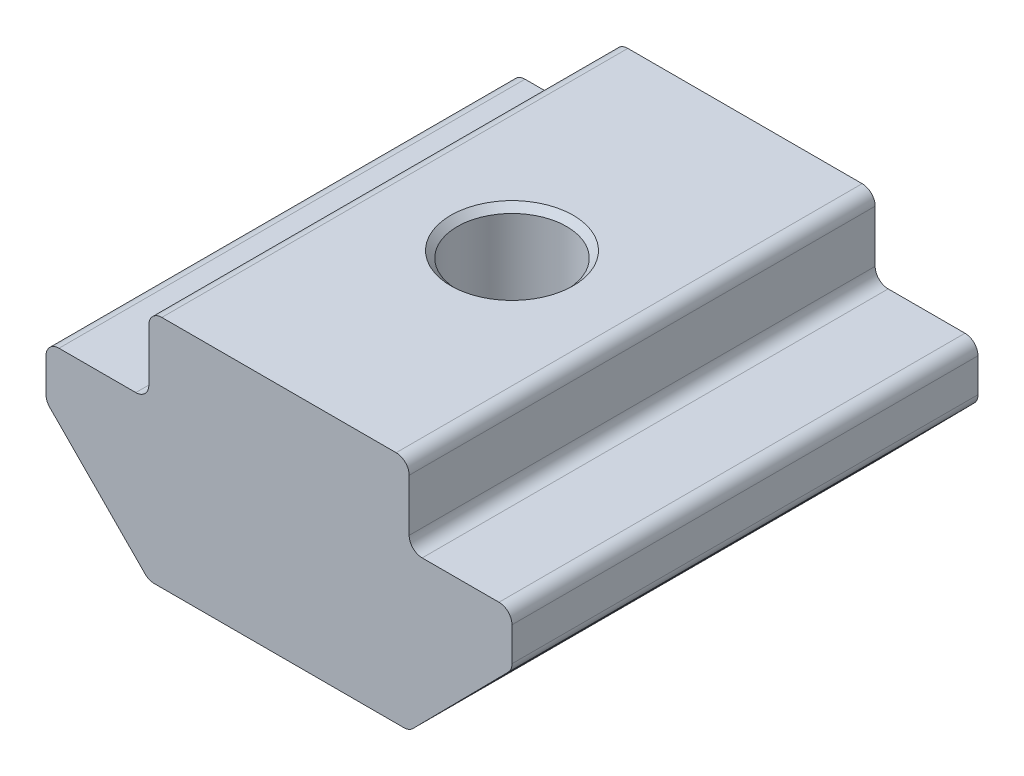
ISO-10303-21;
HEADER;
FILE_DESCRIPTION(('STEP AP214'),'2;1');
FILE_NAME('part.step','',(''),(''),'','','');
FILE_SCHEMA(('AUTOMOTIVE_DESIGN { 1 0 10303 214 1 1 1 1 }'));
ENDSEC;
DATA;
#1=APPLICATION_CONTEXT('core data for automotive mechanical design processes');
#2=APPLICATION_PROTOCOL_DEFINITION('international standard','automotive_design',2000,#1);
#3=PRODUCT_CONTEXT('',#1,'mechanical');
#4=PRODUCT('Part','Part','',(#3));
#5=PRODUCT_RELATED_PRODUCT_CATEGORY('part','',(#4));
#6=PRODUCT_DEFINITION_FORMATION('','',#4);
#7=PRODUCT_DEFINITION_CONTEXT('part definition',#1,'design');
#8=PRODUCT_DEFINITION('design','',#6,#7);
#9=PRODUCT_DEFINITION_SHAPE('','',#8);
#10=(LENGTH_UNIT() NAMED_UNIT(*) SI_UNIT(.MILLI.,.METRE.));
#11=(NAMED_UNIT(*) PLANE_ANGLE_UNIT() SI_UNIT($,.RADIAN.));
#12=(NAMED_UNIT(*) SI_UNIT($,.STERADIAN.) SOLID_ANGLE_UNIT());
#13=UNCERTAINTY_MEASURE_WITH_UNIT(LENGTH_MEASURE(1.E-05),#10,'distance_accuracy_value','');
#14=(GEOMETRIC_REPRESENTATION_CONTEXT(3) GLOBAL_UNCERTAINTY_ASSIGNED_CONTEXT((#13)) GLOBAL_UNIT_ASSIGNED_CONTEXT((#10,
#11,#12)) REPRESENTATION_CONTEXT('',''));
#15=CARTESIAN_POINT('',(0.,0.,0.));
#16=DIRECTION('',(0.,0.,1.));
#17=DIRECTION('',(1.,0.,0.));
#18=AXIS2_PLACEMENT_3D('',#15,#16,#17);
#19=CARTESIAN_POINT('',(-5.,1.5,8.95));
#20=DIRECTION('',(1.,0.,0.));
#21=DIRECTION('',(0.,0.,-1.));
#22=AXIS2_PLACEMENT_3D('',#19,#20,#21);
#23=PLANE('',#22);
#24=DIRECTION('',(0.,-1.,0.));
#25=VECTOR('',#24,1.);
#26=CARTESIAN_POINT('',(-5.,1.5,-8.95));
#27=LINE('',#26,#25);
#28=CARTESIAN_POINT('',(-5.,4.,-8.95));
#29=VERTEX_POINT('',#28);
#30=CARTESIAN_POINT('',(-5.,2.,-8.95));
#31=VERTEX_POINT('',#30);
#32=EDGE_CURVE('E184',#29,#31,#27,.T.);
#33=ORIENTED_EDGE('',*,*,#32,.T.);
#34=DIRECTION('',(0.,0.,-1.));
#35=VECTOR('',#34,1.);
#36=CARTESIAN_POINT('',(-5.,2.,8.95));
#37=LINE('',#36,#35);
#38=CARTESIAN_POINT('',(-5.,2.,8.95));
#39=VERTEX_POINT('',#38);
#40=EDGE_CURVE('E160',#31,#39,#37,.F.);
#41=ORIENTED_EDGE('',*,*,#40,.T.);
#42=DIRECTION('',(0.,-1.,0.));
#43=VECTOR('',#42,1.);
#44=CARTESIAN_POINT('',(-5.,1.5,8.95));
#45=LINE('',#44,#43);
#46=CARTESIAN_POINT('',(-5.,4.,8.95));
#47=VERTEX_POINT('',#46);
#48=EDGE_CURVE('E212',#47,#39,#45,.T.);
#49=ORIENTED_EDGE('',*,*,#48,.F.);
#50=DIRECTION('',(0.,0.,-1.));
#51=VECTOR('',#50,1.);
#52=CARTESIAN_POINT('',(-5.,4.,8.95));
#53=LINE('',#52,#51);
#54=EDGE_CURVE('E176',#47,#29,#53,.T.);
#55=ORIENTED_EDGE('',*,*,#54,.T.);
#56=EDGE_LOOP('',(#33,#41,#49,#55));
#57=FACE_BOUND('',#56,.T.);
#58=ADVANCED_FACE('F16',(#57),#23,.F.);
#59=CARTESIAN_POINT('',(-8.95,1.5,8.95));
#60=DIRECTION('',(0.,-1.,0.));
#61=DIRECTION('',(0.,0.,-1.));
#62=AXIS2_PLACEMENT_3D('',#59,#60,#61);
#63=PLANE('',#62);
#64=DIRECTION('',(-1.,0.,0.));
#65=VECTOR('',#64,1.);
#66=CARTESIAN_POINT('',(-8.95,1.5,8.95));
#67=LINE('',#66,#65);
#68=CARTESIAN_POINT('',(-5.5,1.5,8.95));
#69=VERTEX_POINT('',#68);
#70=CARTESIAN_POINT('',(-8.45,1.5,8.95));
#71=VERTEX_POINT('',#70);
#72=EDGE_CURVE('E175',#69,#71,#67,.T.);
#73=ORIENTED_EDGE('',*,*,#72,.F.);
#74=DIRECTION('',(0.,0.,-1.));
#75=VECTOR('',#74,1.);
#76=CARTESIAN_POINT('',(-5.5,1.5,-8.95));
#77=LINE('',#76,#75);
#78=CARTESIAN_POINT('',(-5.5,1.5,-8.95));
#79=VERTEX_POINT('',#78);
#80=EDGE_CURVE('E159',#69,#79,#77,.T.);
#81=ORIENTED_EDGE('',*,*,#80,.T.);
#82=DIRECTION('',(-1.,0.,0.));
#83=VECTOR('',#82,1.);
#84=CARTESIAN_POINT('',(-8.95,1.5,-8.95));
#85=LINE('',#84,#83);
#86=CARTESIAN_POINT('',(-8.45,1.5,-8.95));
#87=VERTEX_POINT('',#86);
#88=EDGE_CURVE('E172',#79,#87,#85,.T.);
#89=ORIENTED_EDGE('',*,*,#88,.T.);
#90=DIRECTION('',(0.,0.,-1.));
#91=VECTOR('',#90,1.);
#92=CARTESIAN_POINT('',(-8.45,1.5,8.95));
#93=LINE('',#92,#91);
#94=EDGE_CURVE('E177',#87,#71,#93,.F.);
#95=ORIENTED_EDGE('',*,*,#94,.T.);
#96=EDGE_LOOP('',(#73,#81,#89,#95));
#97=FACE_BOUND('',#96,.T.);
#98=ADVANCED_FACE('F171',(#97),#63,.F.);
#99=CARTESIAN_POINT('',(-8.95,1.5,8.95));
#100=DIRECTION('',(1.,0.,0.));
#101=DIRECTION('',(0.,0.,-1.));
#102=AXIS2_PLACEMENT_3D('',#99,#100,#101);
#103=PLANE('',#102);
#104=DIRECTION('',(0.,-1.,0.));
#105=VECTOR('',#104,1.);
#106=CARTESIAN_POINT('',(-8.95,1.5,-8.95));
#107=LINE('',#106,#105);
#108=CARTESIAN_POINT('',(-8.95,0.999999999999999,-8.95));
#109=VERTEX_POINT('',#108);
#110=CARTESIAN_POINT('',(-8.95,-0.294732900044921,-8.95));
#111=VERTEX_POINT('',#110);
#112=EDGE_CURVE('E183',#109,#111,#107,.T.);
#113=ORIENTED_EDGE('',*,*,#112,.T.);
#114=DIRECTION('',(0.,0.,-1.));
#115=VECTOR('',#114,1.);
#116=CARTESIAN_POINT('',(-8.95,-0.294732900044921,8.95));
#117=LINE('',#116,#115);
#118=CARTESIAN_POINT('',(-8.95,-0.294732900044921,8.95));
#119=VERTEX_POINT('',#118);
#120=EDGE_CURVE('E280',#111,#119,#117,.F.);
#121=ORIENTED_EDGE('',*,*,#120,.T.);
#122=DIRECTION('',(0.,-1.,0.));
#123=VECTOR('',#122,1.);
#124=CARTESIAN_POINT('',(-8.95,1.5,8.95));
#125=LINE('',#124,#123);
#126=CARTESIAN_POINT('',(-8.95,0.999999999999999,8.95));
#127=VERTEX_POINT('',#126);
#128=EDGE_CURVE('E420',#127,#119,#125,.T.);
#129=ORIENTED_EDGE('',*,*,#128,.F.);
#130=DIRECTION('',(0.,0.,-1.));
#131=VECTOR('',#130,1.);
#132=CARTESIAN_POINT('',(-8.95,0.999999999999999,8.95));
#133=LINE('',#132,#131);
#134=EDGE_CURVE('E277',#127,#109,#133,.T.);
#135=ORIENTED_EDGE('',*,*,#134,.T.);
#136=EDGE_LOOP('',(#113,#121,#129,#135));
#137=FACE_BOUND('',#136,.T.);
#138=ADVANCED_FACE('F312',(#137),#103,.F.);
#139=CARTESIAN_POINT('',(-8.95,-0.500000000000001,8.95));
#140=DIRECTION('',(0.711539921163849,0.702645672149302,0.));
#141=DIRECTION('',(-0.702645672149302,0.711539921163849,0.));
#142=AXIS2_PLACEMENT_3D('',#139,#140,#141);
#143=PLANE('',#142);
#144=DIRECTION('',(0.702645672149302,-0.711539921163849,0.));
#145=VECTOR('',#144,1.);
#146=CARTESIAN_POINT('',(-8.95,-0.500000000000001,-8.95));
#147=LINE('',#146,#145);
#148=CARTESIAN_POINT('',(-8.80576996058193,-0.646055736119572,-8.95));
#149=VERTEX_POINT('',#148);
#150=CARTESIAN_POINT('',(-5.14681869937628,-4.35132283607465,-8.95));
#151=VERTEX_POINT('',#150);
#152=EDGE_CURVE('E187',#149,#151,#147,.T.);
#153=ORIENTED_EDGE('',*,*,#152,.T.);
#154=DIRECTION('',(0.,0.,-1.));
#155=VECTOR('',#154,1.);
#156=CARTESIAN_POINT('',(-5.14681869937628,-4.35132283607465,8.95));
#157=LINE('',#156,#155);
#158=CARTESIAN_POINT('',(-5.14681869937628,-4.35132283607465,8.95));
#159=VERTEX_POINT('',#158);
#160=EDGE_CURVE('E261',#151,#159,#157,.F.);
#161=ORIENTED_EDGE('',*,*,#160,.T.);
#162=DIRECTION('',(0.702645672149302,-0.711539921163849,0.));
#163=VECTOR('',#162,1.);
#164=CARTESIAN_POINT('',(-8.95,-0.500000000000001,8.95));
#165=LINE('',#164,#163);
#166=CARTESIAN_POINT('',(-8.80576996058193,-0.646055736119572,8.95));
#167=VERTEX_POINT('',#166);
#168=EDGE_CURVE('E413',#167,#159,#165,.T.);
#169=ORIENTED_EDGE('',*,*,#168,.F.);
#170=DIRECTION('',(0.,0.,-1.));
#171=VECTOR('',#170,1.);
#172=CARTESIAN_POINT('',(-8.80576996058193,-0.646055736119572,8.95));
#173=LINE('',#172,#171);
#174=EDGE_CURVE('E258',#167,#149,#173,.T.);
#175=ORIENTED_EDGE('',*,*,#174,.T.);
#176=EDGE_LOOP('',(#153,#161,#169,#175));
#177=FACE_BOUND('',#176,.T.);
#178=ADVANCED_FACE('F409',(#177),#143,.F.);
#179=CARTESIAN_POINT('',(5.,-4.5,8.95));
#180=DIRECTION('',(0.,1.,0.));
#181=DIRECTION('',(-1.,0.,0.));
#182=AXIS2_PLACEMENT_3D('',#179,#180,#181);
#183=PLANE('',#182);
#184=CARTESIAN_POINT('',(0.,-4.5,0.));
#185=DIRECTION('',(0.,1.,0.));
#186=DIRECTION('',(-1.,0.,0.));
#187=AXIS2_PLACEMENT_3D('',#184,#185,#186);
#188=CIRCLE('',#187,2.1);
#189=CARTESIAN_POINT('',(-2.1,-4.5,0.));
#190=VERTEX_POINT('',#189);
#191=EDGE_CURVE('E189',#190,#190,#188,.T.);
#192=ORIENTED_EDGE('',*,*,#191,.T.);
#193=EDGE_LOOP('',(#192));
#194=FACE_BOUND('',#193,.T.);
#195=DIRECTION('',(1.,0.,0.));
#196=VECTOR('',#195,1.);
#197=CARTESIAN_POINT('',(5.,-4.5,-8.95));
#198=LINE('',#197,#196);
#199=CARTESIAN_POINT('',(-4.79104873879436,-4.5,-8.95));
#200=VERTEX_POINT('',#199);
#201=CARTESIAN_POINT('',(4.79104873879436,-4.5,-8.95));
#202=VERTEX_POINT('',#201);
#203=EDGE_CURVE('E195',#200,#202,#198,.T.);
#204=ORIENTED_EDGE('',*,*,#203,.T.);
#205=DIRECTION('',(0.,0.,-1.));
#206=VECTOR('',#205,1.);
#207=CARTESIAN_POINT('',(4.79104873879436,-4.5,8.95));
#208=LINE('',#207,#206);
#209=CARTESIAN_POINT('',(4.79104873879436,-4.5,8.95));
#210=VERTEX_POINT('',#209);
#211=EDGE_CURVE('E241',#202,#210,#208,.F.);
#212=ORIENTED_EDGE('',*,*,#211,.T.);
#213=DIRECTION('',(1.,0.,0.));
#214=VECTOR('',#213,1.);
#215=CARTESIAN_POINT('',(5.,-4.5,8.95));
#216=LINE('',#215,#214);
#217=CARTESIAN_POINT('',(-4.79104873879436,-4.5,8.95));
#218=VERTEX_POINT('',#217);
#219=EDGE_CURVE('E371',#218,#210,#216,.T.);
#220=ORIENTED_EDGE('',*,*,#219,.F.);
#221=DIRECTION('',(0.,0.,-1.));
#222=VECTOR('',#221,1.);
#223=CARTESIAN_POINT('',(-4.79104873879436,-4.5,8.95));
#224=LINE('',#223,#222);
#225=EDGE_CURVE('E238',#218,#200,#224,.T.);
#226=ORIENTED_EDGE('',*,*,#225,.T.);
#227=EDGE_LOOP('',(#204,#212,#220,#226));
#228=FACE_BOUND('',#227,.T.);
#229=ADVANCED_FACE('F402',(#194,#228),#183,.F.);
#230=CARTESIAN_POINT('',(8.95,-0.500000000000001,8.95));
#231=DIRECTION('',(-0.71153992116385,0.702645672149301,0.));
#232=DIRECTION('',(-0.702645672149301,-0.71153992116385,0.));
#233=AXIS2_PLACEMENT_3D('',#230,#231,#232);
#234=PLANE('',#233);
#235=DIRECTION('',(0.702645672149301,0.71153992116385,0.));
#236=VECTOR('',#235,1.);
#237=CARTESIAN_POINT('',(8.95,-0.500000000000001,8.95));
#238=LINE('',#237,#236);
#239=CARTESIAN_POINT('',(5.14681869937628,-4.35132283607465,8.95));
#240=VERTEX_POINT('',#239);
#241=CARTESIAN_POINT('',(8.80576996058192,-0.646055736119571,8.95));
#242=VERTEX_POINT('',#241);
#243=EDGE_CURVE('E361',#240,#242,#238,.T.);
#244=ORIENTED_EDGE('',*,*,#243,.F.);
#245=DIRECTION('',(0.,0.,-1.));
#246=VECTOR('',#245,1.);
#247=CARTESIAN_POINT('',(5.14681869937628,-4.35132283607465,8.95));
#248=LINE('',#247,#246);
#249=CARTESIAN_POINT('',(5.14681869937628,-4.35132283607465,-8.95));
#250=VERTEX_POINT('',#249);
#251=EDGE_CURVE('E220',#240,#250,#248,.T.);
#252=ORIENTED_EDGE('',*,*,#251,.T.);
#253=DIRECTION('',(0.702645672149301,0.71153992116385,0.));
#254=VECTOR('',#253,1.);
#255=CARTESIAN_POINT('',(8.95,-0.500000000000001,-8.95));
#256=LINE('',#255,#254);
#257=CARTESIAN_POINT('',(8.80576996058192,-0.646055736119571,-8.95));
#258=VERTEX_POINT('',#257);
#259=EDGE_CURVE('E198',#250,#258,#256,.T.);
#260=ORIENTED_EDGE('',*,*,#259,.T.);
#261=DIRECTION('',(0.,0.,-1.));
#262=VECTOR('',#261,1.);
#263=CARTESIAN_POINT('',(8.80576996058192,-0.646055736119571,8.95));
#264=LINE('',#263,#262);
#265=EDGE_CURVE('E218',#258,#242,#264,.F.);
#266=ORIENTED_EDGE('',*,*,#265,.T.);
#267=EDGE_LOOP('',(#244,#252,#260,#266));
#268=FACE_BOUND('',#267,.T.);
#269=ADVANCED_FACE('F396',(#268),#234,.F.);
#270=CARTESIAN_POINT('',(8.95,1.5,8.95));
#271=DIRECTION('',(-1.,0.,0.));
#272=DIRECTION('',(0.,0.,1.));
#273=AXIS2_PLACEMENT_3D('',#270,#271,#272);
#274=PLANE('',#273);
#275=DIRECTION('',(0.,1.,0.));
#276=VECTOR('',#275,1.);
#277=CARTESIAN_POINT('',(8.95,1.5,8.95));
#278=LINE('',#277,#276);
#279=CARTESIAN_POINT('',(8.95,-0.29473290004492,8.95));
#280=VERTEX_POINT('',#279);
#281=CARTESIAN_POINT('',(8.95,0.999999999999999,8.95));
#282=VERTEX_POINT('',#281);
#283=EDGE_CURVE('E358',#280,#282,#278,.T.);
#284=ORIENTED_EDGE('',*,*,#283,.F.);
#285=DIRECTION('',(0.,0.,-1.));
#286=VECTOR('',#285,1.);
#287=CARTESIAN_POINT('',(8.95,-0.29473290004492,8.95));
#288=LINE('',#287,#286);
#289=CARTESIAN_POINT('',(8.95,-0.29473290004492,-8.95));
#290=VERTEX_POINT('',#289);
#291=EDGE_CURVE('E166',#280,#290,#288,.T.);
#292=ORIENTED_EDGE('',*,*,#291,.T.);
#293=DIRECTION('',(0.,1.,0.));
#294=VECTOR('',#293,1.);
#295=CARTESIAN_POINT('',(8.95,1.5,-8.95));
#296=LINE('',#295,#294);
#297=CARTESIAN_POINT('',(8.95,0.999999999999999,-8.95));
#298=VERTEX_POINT('',#297);
#299=EDGE_CURVE('E201',#290,#298,#296,.T.);
#300=ORIENTED_EDGE('',*,*,#299,.T.);
#301=DIRECTION('',(0.,0.,-1.));
#302=VECTOR('',#301,1.);
#303=CARTESIAN_POINT('',(8.95,0.999999999999999,8.95));
#304=LINE('',#303,#302);
#305=EDGE_CURVE('E282',#298,#282,#304,.F.);
#306=ORIENTED_EDGE('',*,*,#305,.T.);
#307=EDGE_LOOP('',(#284,#292,#300,#306));
#308=FACE_BOUND('',#307,.T.);
#309=ADVANCED_FACE('F363',(#308),#274,.F.);
#310=CARTESIAN_POINT('',(5.,1.5,8.95));
#311=DIRECTION('',(0.,-1.,0.));
#312=DIRECTION('',(0.,0.,-1.));
#313=AXIS2_PLACEMENT_3D('',#310,#311,#312);
#314=PLANE('',#313);
#315=DIRECTION('',(-1.,0.,0.));
#316=VECTOR('',#315,1.);
#317=CARTESIAN_POINT('',(5.,1.5,-8.95));
#318=LINE('',#317,#316);
#319=CARTESIAN_POINT('',(8.45,1.5,-8.95));
#320=VERTEX_POINT('',#319);
#321=CARTESIAN_POINT('',(5.5,1.5,-8.95));
#322=VERTEX_POINT('',#321);
#323=EDGE_CURVE('E204',#320,#322,#318,.T.);
#324=ORIENTED_EDGE('',*,*,#323,.T.);
#325=DIRECTION('',(0.,0.,-1.));
#326=VECTOR('',#325,1.);
#327=CARTESIAN_POINT('',(5.5,1.5,8.95));
#328=LINE('',#327,#326);
#329=CARTESIAN_POINT('',(5.5,1.5,8.95));
#330=VERTEX_POINT('',#329);
#331=EDGE_CURVE('E275',#322,#330,#328,.F.);
#332=ORIENTED_EDGE('',*,*,#331,.T.);
#333=DIRECTION('',(-1.,0.,0.));
#334=VECTOR('',#333,1.);
#335=CARTESIAN_POINT('',(5.,1.5,8.95));
#336=LINE('',#335,#334);
#337=CARTESIAN_POINT('',(8.45,1.5,8.95));
#338=VERTEX_POINT('',#337);
#339=EDGE_CURVE('E366',#338,#330,#336,.T.);
#340=ORIENTED_EDGE('',*,*,#339,.F.);
#341=DIRECTION('',(0.,0.,-1.));
#342=VECTOR('',#341,1.);
#343=CARTESIAN_POINT('',(8.45,1.5,8.95));
#344=LINE('',#343,#342);
#345=EDGE_CURVE('E272',#338,#320,#344,.T.);
#346=ORIENTED_EDGE('',*,*,#345,.T.);
#347=EDGE_LOOP('',(#324,#332,#340,#346));
#348=FACE_BOUND('',#347,.T.);
#349=ADVANCED_FACE('F392',(#348),#314,.F.);
#350=CARTESIAN_POINT('',(5.,4.5,8.95));
#351=DIRECTION('',(-1.,0.,0.));
#352=DIRECTION('',(0.,0.,1.));
#353=AXIS2_PLACEMENT_3D('',#350,#351,#352);
#354=PLANE('',#353);
#355=DIRECTION('',(0.,1.,0.));
#356=VECTOR('',#355,1.);
#357=CARTESIAN_POINT('',(5.,4.5,8.95));
#358=LINE('',#357,#356);
#359=CARTESIAN_POINT('',(5.,2.,8.95));
#360=VERTEX_POINT('',#359);
#361=CARTESIAN_POINT('',(5.,4.,8.95));
#362=VERTEX_POINT('',#361);
#363=EDGE_CURVE('E369',#360,#362,#358,.T.);
#364=ORIENTED_EDGE('',*,*,#363,.F.);
#365=DIRECTION('',(0.,0.,-1.));
#366=VECTOR('',#365,1.);
#367=CARTESIAN_POINT('',(5.,2.,-8.95));
#368=LINE('',#367,#366);
#369=CARTESIAN_POINT('',(5.,2.,-8.95));
#370=VERTEX_POINT('',#369);
#371=EDGE_CURVE('E269',#360,#370,#368,.T.);
#372=ORIENTED_EDGE('',*,*,#371,.T.);
#373=DIRECTION('',(0.,1.,0.));
#374=VECTOR('',#373,1.);
#375=CARTESIAN_POINT('',(5.,4.5,-8.95));
#376=LINE('',#375,#374);
#377=CARTESIAN_POINT('',(5.,4.,-8.95));
#378=VERTEX_POINT('',#377);
#379=EDGE_CURVE('E207',#370,#378,#376,.T.);
#380=ORIENTED_EDGE('',*,*,#379,.T.);
#381=DIRECTION('',(0.,0.,-1.));
#382=VECTOR('',#381,1.);
#383=CARTESIAN_POINT('',(5.,4.,8.95));
#384=LINE('',#383,#382);
#385=EDGE_CURVE('E267',#378,#362,#384,.F.);
#386=ORIENTED_EDGE('',*,*,#385,.T.);
#387=EDGE_LOOP('',(#364,#372,#380,#386));
#388=FACE_BOUND('',#387,.T.);
#389=ADVANCED_FACE('F386',(#388),#354,.F.);
#390=CARTESIAN_POINT('',(-5.,4.5,8.95));
#391=DIRECTION('',(0.,-1.,0.));
#392=DIRECTION('',(0.,0.,-1.));
#393=AXIS2_PLACEMENT_3D('',#390,#391,#392);
#394=PLANE('',#393);
#395=CARTESIAN_POINT('',(0.,4.5,0.));
#396=DIRECTION('',(0.,-1.,0.));
#397=DIRECTION('',(0.,0.,-1.));
#398=AXIS2_PLACEMENT_3D('',#395,#396,#397);
#399=CIRCLE('',#398,2.35);
#400=CARTESIAN_POINT('',(0.,4.5,-2.35));
#401=VERTEX_POINT('',#400);
#402=EDGE_CURVE('E10',#401,#401,#399,.T.);
#403=ORIENTED_EDGE('',*,*,#402,.T.);
#404=EDGE_LOOP('',(#403));
#405=FACE_BOUND('',#404,.T.);
#406=DIRECTION('',(-1.,0.,0.));
#407=VECTOR('',#406,1.);
#408=CARTESIAN_POINT('',(-5.,4.5,-8.95));
#409=LINE('',#408,#407);
#410=CARTESIAN_POINT('',(4.5,4.5,-8.95));
#411=VERTEX_POINT('',#410);
#412=CARTESIAN_POINT('',(-4.5,4.5,-8.95));
#413=VERTEX_POINT('',#412);
#414=EDGE_CURVE('E210',#411,#413,#409,.T.);
#415=ORIENTED_EDGE('',*,*,#414,.T.);
#416=DIRECTION('',(0.,0.,-1.));
#417=VECTOR('',#416,1.);
#418=CARTESIAN_POINT('',(-4.5,4.5,8.95));
#419=LINE('',#418,#417);
#420=CARTESIAN_POINT('',(-4.5,4.5,8.95));
#421=VERTEX_POINT('',#420);
#422=EDGE_CURVE('E31',#413,#421,#419,.F.);
#423=ORIENTED_EDGE('',*,*,#422,.T.);
#424=DIRECTION('',(-1.,0.,0.));
#425=VECTOR('',#424,1.);
#426=CARTESIAN_POINT('',(-5.,4.5,8.95));
#427=LINE('',#426,#425);
#428=CARTESIAN_POINT('',(4.5,4.5,8.95));
#429=VERTEX_POINT('',#428);
#430=EDGE_CURVE('E213',#429,#421,#427,.T.);
#431=ORIENTED_EDGE('',*,*,#430,.F.);
#432=DIRECTION('',(0.,0.,-1.));
#433=VECTOR('',#432,1.);
#434=CARTESIAN_POINT('',(4.5,4.5,8.95));
#435=LINE('',#434,#433);
#436=EDGE_CURVE('E263',#429,#411,#435,.T.);
#437=ORIENTED_EDGE('',*,*,#436,.T.);
#438=EDGE_LOOP('',(#415,#423,#431,#437));
#439=FACE_BOUND('',#438,.T.);
#440=ADVANCED_FACE('F381',(#405,#439),#394,.F.);
#441=CARTESIAN_POINT('',(0.,0.,8.95));
#442=DIRECTION('',(0.,0.,-1.));
#443=DIRECTION('',(-1.,0.,0.));
#444=AXIS2_PLACEMENT_3D('',#441,#442,#443);
#445=PLANE('',#444);
#446=ORIENTED_EDGE('',*,*,#219,.T.);
#447=CARTESIAN_POINT('',(4.79104873879436,-4.,8.95));
#448=DIRECTION('',(0.,0.,-1.));
#449=DIRECTION('',(-1.,0.,0.));
#450=AXIS2_PLACEMENT_3D('',#447,#448,#449);
#451=CIRCLE('',#450,0.5);
#452=EDGE_CURVE('E256',#210,#240,#451,.F.);
#453=ORIENTED_EDGE('',*,*,#452,.T.);
#454=ORIENTED_EDGE('',*,*,#243,.T.);
#455=CARTESIAN_POINT('',(8.45,-0.29473290004492,8.95));
#456=DIRECTION('',(0.,0.,-1.));
#457=DIRECTION('',(-1.,0.,0.));
#458=AXIS2_PLACEMENT_3D('',#455,#456,#457);
#459=CIRCLE('',#458,0.5);
#460=EDGE_CURVE('E245',#242,#280,#459,.F.);
#461=ORIENTED_EDGE('',*,*,#460,.T.);
#462=ORIENTED_EDGE('',*,*,#283,.T.);
#463=CARTESIAN_POINT('',(8.45,0.999999999999999,8.95));
#464=DIRECTION('',(0.,0.,-1.));
#465=DIRECTION('',(-1.,0.,0.));
#466=AXIS2_PLACEMENT_3D('',#463,#464,#465);
#467=CIRCLE('',#466,0.5);
#468=EDGE_CURVE('E243',#282,#338,#467,.F.);
#469=ORIENTED_EDGE('',*,*,#468,.T.);
#470=ORIENTED_EDGE('',*,*,#339,.T.);
#471=CARTESIAN_POINT('',(5.5,2.,8.95));
#472=DIRECTION('',(0.,0.,-1.));
#473=DIRECTION('',(-1.,0.,0.));
#474=AXIS2_PLACEMENT_3D('',#471,#472,#473);
#475=CIRCLE('',#474,0.5);
#476=EDGE_CURVE('E289',#330,#360,#475,.T.);
#477=ORIENTED_EDGE('',*,*,#476,.T.);
#478=ORIENTED_EDGE('',*,*,#363,.T.);
#479=CARTESIAN_POINT('',(4.5,4.,8.95));
#480=DIRECTION('',(0.,0.,-1.));
#481=DIRECTION('',(-1.,0.,0.));
#482=AXIS2_PLACEMENT_3D('',#479,#480,#481);
#483=CIRCLE('',#482,0.5);
#484=EDGE_CURVE('E38',#362,#429,#483,.F.);
#485=ORIENTED_EDGE('',*,*,#484,.T.);
#486=ORIENTED_EDGE('',*,*,#430,.T.);
#487=CARTESIAN_POINT('',(-4.5,4.,8.95));
#488=DIRECTION('',(0.,0.,-1.));
#489=DIRECTION('',(-1.,0.,0.));
#490=AXIS2_PLACEMENT_3D('',#487,#488,#489);
#491=CIRCLE('',#490,0.5);
#492=EDGE_CURVE('E252',#421,#47,#491,.F.);
#493=ORIENTED_EDGE('',*,*,#492,.T.);
#494=ORIENTED_EDGE('',*,*,#48,.T.);
#495=CARTESIAN_POINT('',(-5.5,2.,8.95));
#496=DIRECTION('',(0.,0.,-1.));
#497=DIRECTION('',(-1.,0.,0.));
#498=AXIS2_PLACEMENT_3D('',#495,#496,#497);
#499=CIRCLE('',#498,0.5);
#500=EDGE_CURVE('E165',#39,#69,#499,.T.);
#501=ORIENTED_EDGE('',*,*,#500,.T.);
#502=ORIENTED_EDGE('',*,*,#72,.T.);
#503=CARTESIAN_POINT('',(-8.45,0.999999999999999,8.95));
#504=DIRECTION('',(0.,0.,-1.));
#505=DIRECTION('',(-1.,0.,0.));
#506=AXIS2_PLACEMENT_3D('',#503,#504,#505);
#507=CIRCLE('',#506,0.5);
#508=EDGE_CURVE('E247',#71,#127,#507,.F.);
#509=ORIENTED_EDGE('',*,*,#508,.T.);
#510=ORIENTED_EDGE('',*,*,#128,.T.);
#511=CARTESIAN_POINT('',(-8.45,-0.294732900044921,8.95));
#512=DIRECTION('',(0.,0.,-1.));
#513=DIRECTION('',(-1.,0.,0.));
#514=AXIS2_PLACEMENT_3D('',#511,#512,#513);
#515=CIRCLE('',#514,0.5);
#516=EDGE_CURVE('E249',#119,#167,#515,.F.);
#517=ORIENTED_EDGE('',*,*,#516,.T.);
#518=ORIENTED_EDGE('',*,*,#168,.T.);
#519=CARTESIAN_POINT('',(-4.79104873879436,-4.,8.95));
#520=DIRECTION('',(0.,0.,-1.));
#521=DIRECTION('',(-1.,0.,0.));
#522=AXIS2_PLACEMENT_3D('',#519,#520,#521);
#523=CIRCLE('',#522,0.5);
#524=EDGE_CURVE('E254',#159,#218,#523,.F.);
#525=ORIENTED_EDGE('',*,*,#524,.T.);
#526=EDGE_LOOP('',(#446,#453,#454,#461,#462,#469,#470,#477,#478,#485,#486,#493,#494,#501,#502,
#509,#510,#517,#518,#525));
#527=FACE_BOUND('',#526,.T.);
#528=ADVANCED_FACE('F357',(#527),#445,.F.);
#529=CARTESIAN_POINT('',(0.,0.,-8.95));
#530=DIRECTION('',(0.,0.,-1.));
#531=DIRECTION('',(-1.,0.,0.));
#532=AXIS2_PLACEMENT_3D('',#529,#530,#531);
#533=PLANE('',#532);
#534=ORIENTED_EDGE('',*,*,#259,.F.);
#535=CARTESIAN_POINT('',(4.79104873879436,-4.,-8.95));
#536=DIRECTION('',(0.,0.,-1.));
#537=DIRECTION('',(-1.,0.,0.));
#538=AXIS2_PLACEMENT_3D('',#535,#536,#537);
#539=CIRCLE('',#538,0.5);
#540=EDGE_CURVE('E236',#250,#202,#539,.T.);
#541=ORIENTED_EDGE('',*,*,#540,.T.);
#542=ORIENTED_EDGE('',*,*,#203,.F.);
#543=CARTESIAN_POINT('',(-4.79104873879436,-4.,-8.95));
#544=DIRECTION('',(0.,0.,-1.));
#545=DIRECTION('',(-1.,0.,0.));
#546=AXIS2_PLACEMENT_3D('',#543,#544,#545);
#547=CIRCLE('',#546,0.5);
#548=EDGE_CURVE('E234',#200,#151,#547,.T.);
#549=ORIENTED_EDGE('',*,*,#548,.T.);
#550=ORIENTED_EDGE('',*,*,#152,.F.);
#551=CARTESIAN_POINT('',(-8.45,-0.294732900044921,-8.95));
#552=DIRECTION('',(0.,0.,-1.));
#553=DIRECTION('',(-1.,0.,0.));
#554=AXIS2_PLACEMENT_3D('',#551,#552,#553);
#555=CIRCLE('',#554,0.5);
#556=EDGE_CURVE('E228',#149,#111,#555,.T.);
#557=ORIENTED_EDGE('',*,*,#556,.T.);
#558=ORIENTED_EDGE('',*,*,#112,.F.);
#559=CARTESIAN_POINT('',(-8.45,0.999999999999999,-8.95));
#560=DIRECTION('',(0.,0.,-1.));
#561=DIRECTION('',(-1.,0.,0.));
#562=AXIS2_PLACEMENT_3D('',#559,#560,#561);
#563=CIRCLE('',#562,0.5);
#564=EDGE_CURVE('E182',#109,#87,#563,.T.);
#565=ORIENTED_EDGE('',*,*,#564,.T.);
#566=ORIENTED_EDGE('',*,*,#88,.F.);
#567=CARTESIAN_POINT('',(-5.5,2.,-8.95));
#568=DIRECTION('',(0.,0.,-1.));
#569=DIRECTION('',(-1.,0.,0.));
#570=AXIS2_PLACEMENT_3D('',#567,#568,#569);
#571=CIRCLE('',#570,0.5);
#572=EDGE_CURVE('E155',#79,#31,#571,.F.);
#573=ORIENTED_EDGE('',*,*,#572,.T.);
#574=ORIENTED_EDGE('',*,*,#32,.F.);
#575=CARTESIAN_POINT('',(-4.5,4.,-8.95));
#576=DIRECTION('',(0.,0.,-1.));
#577=DIRECTION('',(-1.,0.,0.));
#578=AXIS2_PLACEMENT_3D('',#575,#576,#577);
#579=CIRCLE('',#578,0.5);
#580=EDGE_CURVE('E232',#29,#413,#579,.T.);
#581=ORIENTED_EDGE('',*,*,#580,.T.);
#582=ORIENTED_EDGE('',*,*,#414,.F.);
#583=CARTESIAN_POINT('',(4.5,4.,-8.95));
#584=DIRECTION('',(0.,0.,-1.));
#585=DIRECTION('',(-1.,0.,0.));
#586=AXIS2_PLACEMENT_3D('',#583,#584,#585);
#587=CIRCLE('',#586,0.5);
#588=EDGE_CURVE('E230',#411,#378,#587,.T.);
#589=ORIENTED_EDGE('',*,*,#588,.T.);
#590=ORIENTED_EDGE('',*,*,#379,.F.);
#591=CARTESIAN_POINT('',(5.5,2.,-8.95));
#592=DIRECTION('',(0.,0.,-1.));
#593=DIRECTION('',(-1.,0.,0.));
#594=AXIS2_PLACEMENT_3D('',#591,#592,#593);
#595=CIRCLE('',#594,0.5);
#596=EDGE_CURVE('E287',#370,#322,#595,.F.);
#597=ORIENTED_EDGE('',*,*,#596,.T.);
#598=ORIENTED_EDGE('',*,*,#323,.F.);
#599=CARTESIAN_POINT('',(8.45,0.999999999999999,-8.95));
#600=DIRECTION('',(0.,0.,-1.));
#601=DIRECTION('',(-1.,0.,0.));
#602=AXIS2_PLACEMENT_3D('',#599,#600,#601);
#603=CIRCLE('',#602,0.5);
#604=EDGE_CURVE('E223',#320,#298,#603,.T.);
#605=ORIENTED_EDGE('',*,*,#604,.T.);
#606=ORIENTED_EDGE('',*,*,#299,.F.);
#607=CARTESIAN_POINT('',(8.45,-0.29473290004492,-8.95));
#608=DIRECTION('',(0.,0.,-1.));
#609=DIRECTION('',(-1.,0.,0.));
#610=AXIS2_PLACEMENT_3D('',#607,#608,#609);
#611=CIRCLE('',#610,0.5);
#612=EDGE_CURVE('E225',#290,#258,#611,.T.);
#613=ORIENTED_EDGE('',*,*,#612,.T.);
#614=EDGE_LOOP('',(#534,#541,#542,#549,#550,#557,#558,#565,#566,#573,#574,#581,#582,#589,#590,
#597,#598,#605,#606,#613));
#615=FACE_BOUND('',#614,.T.);
#616=ADVANCED_FACE('F180',(#615),#533,.T.);
#617=CARTESIAN_POINT('',(0.,-4.5,0.));
#618=DIRECTION('',(0.,1.,0.));
#619=DIRECTION('',(-1.,0.,0.));
#620=AXIS2_PLACEMENT_3D('',#617,#618,#619);
#621=CYLINDRICAL_SURFACE('',#620,2.1);
#622=CARTESIAN_POINT('',(0.,4.25,0.));
#623=DIRECTION('',(0.,-1.,0.));
#624=DIRECTION('',(1.,0.,0.));
#625=AXIS2_PLACEMENT_3D('',#622,#623,#624);
#626=CIRCLE('',#625,2.1);
#627=CARTESIAN_POINT('',(2.1,4.25,0.));
#628=VERTEX_POINT('',#627);
#629=EDGE_CURVE('E24',#628,#628,#626,.F.);
#630=ORIENTED_EDGE('',*,*,#629,.T.);
#631=EDGE_LOOP('',(#630));
#632=FACE_BOUND('',#631,.T.);
#633=ORIENTED_EDGE('',*,*,#191,.F.);
#634=EDGE_LOOP('',(#633));
#635=FACE_BOUND('',#634,.T.);
#636=ADVANCED_FACE('F293',(#632,#635),#621,.F.);
#637=CARTESIAN_POINT('',(-5.5,2.,8.95));
#638=DIRECTION('',(0.,0.,1.));
#639=DIRECTION('',(1.,0.,0.));
#640=AXIS2_PLACEMENT_3D('',#637,#638,#639);
#641=CYLINDRICAL_SURFACE('',#640,0.5);
#642=ORIENTED_EDGE('',*,*,#500,.F.);
#643=ORIENTED_EDGE('',*,*,#40,.F.);
#644=ORIENTED_EDGE('',*,*,#572,.F.);
#645=ORIENTED_EDGE('',*,*,#80,.F.);
#646=EDGE_LOOP('',(#642,#643,#644,#645));
#647=FACE_BOUND('',#646,.T.);
#648=ADVANCED_FACE('F158',(#647),#641,.F.);
#649=CARTESIAN_POINT('',(4.79104873879436,-4.,8.95));
#650=DIRECTION('',(0.,0.,-1.));
#651=DIRECTION('',(-1.,0.,0.));
#652=AXIS2_PLACEMENT_3D('',#649,#650,#651);
#653=CYLINDRICAL_SURFACE('',#652,0.5);
#654=ORIENTED_EDGE('',*,*,#452,.F.);
#655=ORIENTED_EDGE('',*,*,#211,.F.);
#656=ORIENTED_EDGE('',*,*,#540,.F.);
#657=ORIENTED_EDGE('',*,*,#251,.F.);
#658=EDGE_LOOP('',(#654,#655,#656,#657));
#659=FACE_BOUND('',#658,.T.);
#660=ADVANCED_FACE('F318',(#659),#653,.T.);
#661=CARTESIAN_POINT('',(-4.79104873879436,-4.,8.95));
#662=DIRECTION('',(0.,0.,-1.));
#663=DIRECTION('',(-1.,0.,0.));
#664=AXIS2_PLACEMENT_3D('',#661,#662,#663);
#665=CYLINDRICAL_SURFACE('',#664,0.5);
#666=ORIENTED_EDGE('',*,*,#524,.F.);
#667=ORIENTED_EDGE('',*,*,#160,.F.);
#668=ORIENTED_EDGE('',*,*,#548,.F.);
#669=ORIENTED_EDGE('',*,*,#225,.F.);
#670=EDGE_LOOP('',(#666,#667,#668,#669));
#671=FACE_BOUND('',#670,.T.);
#672=ADVANCED_FACE('F321',(#671),#665,.T.);
#673=CARTESIAN_POINT('',(-4.5,4.,8.95));
#674=DIRECTION('',(0.,0.,-1.));
#675=DIRECTION('',(-1.,0.,0.));
#676=AXIS2_PLACEMENT_3D('',#673,#674,#675);
#677=CYLINDRICAL_SURFACE('',#676,0.5);
#678=ORIENTED_EDGE('',*,*,#492,.F.);
#679=ORIENTED_EDGE('',*,*,#422,.F.);
#680=ORIENTED_EDGE('',*,*,#580,.F.);
#681=ORIENTED_EDGE('',*,*,#54,.F.);
#682=EDGE_LOOP('',(#678,#679,#680,#681));
#683=FACE_BOUND('',#682,.T.);
#684=ADVANCED_FACE('F325',(#683),#677,.T.);
#685=CARTESIAN_POINT('',(5.5,2.,8.95));
#686=DIRECTION('',(0.,0.,1.));
#687=DIRECTION('',(1.,0.,0.));
#688=AXIS2_PLACEMENT_3D('',#685,#686,#687);
#689=CYLINDRICAL_SURFACE('',#688,0.5);
#690=ORIENTED_EDGE('',*,*,#476,.F.);
#691=ORIENTED_EDGE('',*,*,#331,.F.);
#692=ORIENTED_EDGE('',*,*,#596,.F.);
#693=ORIENTED_EDGE('',*,*,#371,.F.);
#694=EDGE_LOOP('',(#690,#691,#692,#693));
#695=FACE_BOUND('',#694,.T.);
#696=ADVANCED_FACE('F329',(#695),#689,.F.);
#697=CARTESIAN_POINT('',(4.5,4.,8.95));
#698=DIRECTION('',(0.,0.,-1.));
#699=DIRECTION('',(-1.,0.,0.));
#700=AXIS2_PLACEMENT_3D('',#697,#698,#699);
#701=CYLINDRICAL_SURFACE('',#700,0.5);
#702=ORIENTED_EDGE('',*,*,#484,.F.);
#703=ORIENTED_EDGE('',*,*,#385,.F.);
#704=ORIENTED_EDGE('',*,*,#588,.F.);
#705=ORIENTED_EDGE('',*,*,#436,.F.);
#706=EDGE_LOOP('',(#702,#703,#704,#705));
#707=FACE_BOUND('',#706,.T.);
#708=ADVANCED_FACE('F333',(#707),#701,.T.);
#709=CARTESIAN_POINT('',(-8.45,-0.294732900044921,8.95));
#710=DIRECTION('',(0.,0.,-1.));
#711=DIRECTION('',(-1.,0.,0.));
#712=AXIS2_PLACEMENT_3D('',#709,#710,#711);
#713=CYLINDRICAL_SURFACE('',#712,0.5);
#714=ORIENTED_EDGE('',*,*,#516,.F.);
#715=ORIENTED_EDGE('',*,*,#120,.F.);
#716=ORIENTED_EDGE('',*,*,#556,.F.);
#717=ORIENTED_EDGE('',*,*,#174,.F.);
#718=EDGE_LOOP('',(#714,#715,#716,#717));
#719=FACE_BOUND('',#718,.T.);
#720=ADVANCED_FACE('F337',(#719),#713,.T.);
#721=CARTESIAN_POINT('',(-8.45,0.999999999999999,8.95));
#722=DIRECTION('',(0.,0.,-1.));
#723=DIRECTION('',(-1.,0.,0.));
#724=AXIS2_PLACEMENT_3D('',#721,#722,#723);
#725=CYLINDRICAL_SURFACE('',#724,0.5);
#726=ORIENTED_EDGE('',*,*,#508,.F.);
#727=ORIENTED_EDGE('',*,*,#94,.F.);
#728=ORIENTED_EDGE('',*,*,#564,.F.);
#729=ORIENTED_EDGE('',*,*,#134,.F.);
#730=EDGE_LOOP('',(#726,#727,#728,#729));
#731=FACE_BOUND('',#730,.T.);
#732=ADVANCED_FACE('F341',(#731),#725,.T.);
#733=CARTESIAN_POINT('',(8.45,-0.29473290004492,8.95));
#734=DIRECTION('',(0.,0.,-1.));
#735=DIRECTION('',(-1.,0.,0.));
#736=AXIS2_PLACEMENT_3D('',#733,#734,#735);
#737=CYLINDRICAL_SURFACE('',#736,0.5);
#738=ORIENTED_EDGE('',*,*,#460,.F.);
#739=ORIENTED_EDGE('',*,*,#265,.F.);
#740=ORIENTED_EDGE('',*,*,#612,.F.);
#741=ORIENTED_EDGE('',*,*,#291,.F.);
#742=EDGE_LOOP('',(#738,#739,#740,#741));
#743=FACE_BOUND('',#742,.T.);
#744=ADVANCED_FACE('F303',(#743),#737,.T.);
#745=CARTESIAN_POINT('',(8.45,0.999999999999999,8.95));
#746=DIRECTION('',(0.,0.,-1.));
#747=DIRECTION('',(-1.,0.,0.));
#748=AXIS2_PLACEMENT_3D('',#745,#746,#747);
#749=CYLINDRICAL_SURFACE('',#748,0.5);
#750=ORIENTED_EDGE('',*,*,#468,.F.);
#751=ORIENTED_EDGE('',*,*,#305,.F.);
#752=ORIENTED_EDGE('',*,*,#604,.F.);
#753=ORIENTED_EDGE('',*,*,#345,.F.);
#754=EDGE_LOOP('',(#750,#751,#752,#753));
#755=FACE_BOUND('',#754,.T.);
#756=ADVANCED_FACE('F297',(#755),#749,.T.);
#757=CARTESIAN_POINT('',(0.,4.25,0.));
#758=DIRECTION('',(0.,1.,0.));
#759=DIRECTION('',(-1.,0.,0.));
#760=AXIS2_PLACEMENT_3D('',#757,#758,#759);
#761=CONICAL_SURFACE('',#760,2.1,0.785398163397453);
#762=ORIENTED_EDGE('',*,*,#402,.F.);
#763=EDGE_LOOP('',(#762));
#764=FACE_BOUND('',#763,.T.);
#765=ORIENTED_EDGE('',*,*,#629,.F.);
#766=EDGE_LOOP('',(#765));
#767=FACE_BOUND('',#766,.T.);
#768=ADVANCED_FACE('F18',(#764,#767),#761,.F.);
#769=CLOSED_SHELL('',(#58,#98,#138,#178,#229,#269,#309,#349,#389,#440,#528,#616,#636,#648,#660,
#672,#684,#696,#708,#720,#732,#744,#756,#768));
#770=MANIFOLD_SOLID_BREP('B1',#769);
#771=ADVANCED_BREP_SHAPE_REPRESENTATION('',(#18,#770),#14);
#772=SHAPE_DEFINITION_REPRESENTATION(#9,#771);
ENDSEC;
END-ISO-10303-21;
